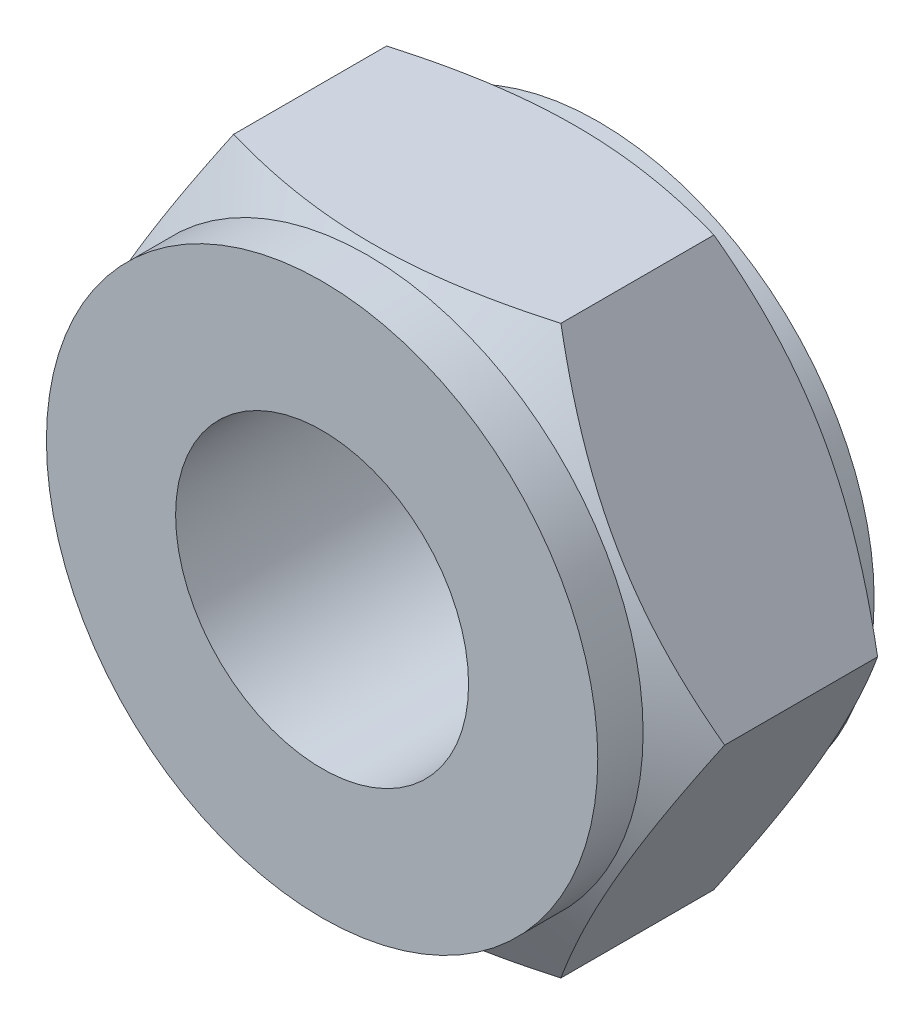
ISO-10303-21;
HEADER;
FILE_DESCRIPTION(('STEP AP214'),'2;1');
FILE_NAME('part.step','',(''),(''),'','','');
FILE_SCHEMA(('AUTOMOTIVE_DESIGN { 1 0 10303 214 1 1 1 1 }'));
ENDSEC;
DATA;
#1=APPLICATION_CONTEXT('core data for automotive mechanical design processes');
#2=APPLICATION_PROTOCOL_DEFINITION('international standard','automotive_design',2000,#1);
#3=PRODUCT_CONTEXT('',#1,'mechanical');
#4=PRODUCT('Part','Part','',(#3));
#5=PRODUCT_RELATED_PRODUCT_CATEGORY('part','',(#4));
#6=PRODUCT_DEFINITION_FORMATION('','',#4);
#7=PRODUCT_DEFINITION_CONTEXT('part definition',#1,'design');
#8=PRODUCT_DEFINITION('design','',#6,#7);
#9=PRODUCT_DEFINITION_SHAPE('','',#8);
#10=(LENGTH_UNIT() NAMED_UNIT(*) SI_UNIT(.MILLI.,.METRE.));
#11=(NAMED_UNIT(*) PLANE_ANGLE_UNIT() SI_UNIT($,.RADIAN.));
#12=(NAMED_UNIT(*) SI_UNIT($,.STERADIAN.) SOLID_ANGLE_UNIT());
#13=UNCERTAINTY_MEASURE_WITH_UNIT(LENGTH_MEASURE(1.E-05),#10,'distance_accuracy_value','');
#14=(GEOMETRIC_REPRESENTATION_CONTEXT(3) GLOBAL_UNCERTAINTY_ASSIGNED_CONTEXT((#13)) GLOBAL_UNIT_ASSIGNED_CONTEXT((#10,
#11,#12)) REPRESENTATION_CONTEXT('',''));
#15=CARTESIAN_POINT('',(0.,0.,0.));
#16=DIRECTION('',(0.,0.,1.));
#17=DIRECTION('',(1.,0.,0.));
#18=AXIS2_PLACEMENT_3D('',#15,#16,#17);
#19=CARTESIAN_POINT('',(0.,0.,3.28));
#20=DIRECTION('',(0.,0.,-1.));
#21=DIRECTION('',(-1.,0.,0.));
#22=AXIS2_PLACEMENT_3D('',#19,#20,#21);
#23=CYLINDRICAL_SURFACE('',#22,3.89);
#24=CARTESIAN_POINT('',(0.,0.,-3.52));
#25=DIRECTION('',(0.,0.,-1.));
#26=DIRECTION('',(-1.,0.,0.));
#27=AXIS2_PLACEMENT_3D('',#24,#25,#26);
#28=CIRCLE('',#27,3.89);
#29=CARTESIAN_POINT('',(-3.89,0.,-3.52));
#30=VERTEX_POINT('',#29);
#31=EDGE_CURVE('E19',#30,#30,#28,.T.);
#32=ORIENTED_EDGE('',*,*,#31,.F.);
#33=EDGE_LOOP('',(#32));
#34=FACE_BOUND('',#33,.T.);
#35=CARTESIAN_POINT('',(0.,0.,-3.26019237883202));
#36=DIRECTION('',(0.,0.,1.));
#37=DIRECTION('',(-1.,0.,0.));
#38=AXIS2_PLACEMENT_3D('',#35,#36,#37);
#39=CIRCLE('',#38,3.89000000006945);
#40=CARTESIAN_POINT('',(-3.89000000006945,0.,-3.26019237883202));
#41=VERTEX_POINT('',#40);
#42=EDGE_CURVE('E178',#41,#41,#39,.T.);
#43=ORIENTED_EDGE('',*,*,#42,.F.);
#44=EDGE_LOOP('',(#43));
#45=FACE_BOUND('',#44,.T.);
#46=ADVANCED_FACE('F16',(#34,#45),#23,.T.);
#47=CARTESIAN_POINT('',(0.,0.,-2.83689361464212));
#48=DIRECTION('',(0.,0.,1.));
#49=DIRECTION('',(1.,0.,0.));
#50=AXIS2_PLACEMENT_3D('',#47,#48,#49);
#51=CONICAL_SURFACE('',#50,4.62317496641163,1.04719755119624);
#52=CARTESIAN_POINT('',(-4.61880215351368,-5.73590683433179E-12,-2.83941825934587));
#53=CARTESIAN_POINT('',(-4.51731796242767,-0.175775775131739,-2.89802716909246));
#54=CARTESIAN_POINT('',(-4.41495776124794,-0.353068844247999,-2.95132890514521));
#55=CARTESIAN_POINT('',(-4.20846506047572,-0.710724693377609,-3.04436548454486));
#56=CARTESIAN_POINT('',(-4.10432889310188,-0.891093826174593,-3.08406741866906));
#57=CARTESIAN_POINT('',(-3.89734706567413,-1.24959686752292,-3.14586634145278));
#58=CARTESIAN_POINT('',(-3.79453324350631,-1.42767563123793,-3.16837468415098));
#59=CARTESIAN_POINT('',(-3.5884220785619,-1.78467064092886,-3.19523992308358));
#60=CARTESIAN_POINT('',(-3.4851254844293,-1.96358559021534,-3.1996190713959));
#61=CARTESIAN_POINT('',(-3.29212687968423,-2.29786897942371,-3.19048567903444));
#62=CARTESIAN_POINT('',(-3.2023959080588,-2.45328758129148,-3.1792156889114));
#63=CARTESIAN_POINT('',(-3.02351853281839,-2.76311228353242,-3.14350365790747));
#64=CARTESIAN_POINT('',(-2.93437274743071,-2.91751731310451,-3.11904942980642));
#65=CARTESIAN_POINT('',(-2.75512686792788,-3.22798028345079,-3.05791859266708));
#66=CARTESIAN_POINT('',(-2.66504944835346,-3.38399895076839,-3.02098297490716));
#67=CARTESIAN_POINT('',(-2.48623772534369,-3.69370994001023,-2.93715473766519));
#68=CARTESIAN_POINT('',(-2.39750113289062,-3.84740622662948,-2.89028180183956));
#69=CARTESIAN_POINT('',(-2.30940107675872,-3.99999999999961,-2.83941825934408));
#70=B_SPLINE_CURVE_WITH_KNOTS('',3,(#52,#53,#54,#55,#56,#57,#58,#59,#60,#61,#62,#63,#64,#65,#66,
#67,#68,#69),.UNSPECIFIED.,.F.,.F.,(4,2,2,2,2,2,2,2,4),(0.,0.634032023113349,1.26958763405349,
1.88941521230476,2.5084817777942,3.04741556526093,3.58684838758453,4.13824324497157,
4.68855594702268),.UNSPECIFIED.);
#71=CARTESIAN_POINT('',(-4.6188021534735,0.,-2.83941825937969));
#72=VERTEX_POINT('',#71);
#73=CARTESIAN_POINT('',(-2.30940107675838,-3.99999999999981,-2.83941825934408));
#74=VERTEX_POINT('',#73);
#75=EDGE_CURVE('E62',#72,#74,#70,.T.);
#76=ORIENTED_EDGE('',*,*,#75,.F.);
#77=CARTESIAN_POINT('',(-2.30940107675872,3.99999999999961,-2.83941825934408));
#78=CARTESIAN_POINT('',(-2.41088526784479,3.82422422487352,-2.89802716909082));
#79=CARTESIAN_POINT('',(-2.51324546902457,3.64693115575717,-2.95132890514373));
#80=CARTESIAN_POINT('',(-2.7197381697969,3.28927530662738,-3.0443654845437));
#81=CARTESIAN_POINT('',(-2.82387433717079,3.1089061738303,-3.08406741866806));
#82=CARTESIAN_POINT('',(-3.03085616459866,2.75040313248178,-3.14586634145211));
#83=CARTESIAN_POINT('',(-3.13366998676653,2.57232436876667,-3.16837468415047));
#84=CARTESIAN_POINT('',(-3.33978115171107,2.21532935907552,-3.19523992308339));
#85=CARTESIAN_POINT('',(-3.44307774584373,2.03641440978893,-3.19961907139588));
#86=CARTESIAN_POINT('',(-3.6360763505888,1.70213102058056,-3.19048567903468));
#87=CARTESIAN_POINT('',(-3.72580732221417,1.5467124187129,-3.17921568891178));
#88=CARTESIAN_POINT('',(-3.90468469745445,1.23688771647217,-3.14350365790813));
#89=CARTESIAN_POINT('',(-3.99383048284208,1.08248268690018,-3.11904942980722));
#90=CARTESIAN_POINT('',(-4.1730763623448,0.772019716554091,-3.05791859266816));
#91=CARTESIAN_POINT('',(-4.26315378191916,0.616001049236596,-3.02098297490839));
#92=CARTESIAN_POINT('',(-4.44196550492881,0.306290059994944,-2.9371547376667));
#93=CARTESIAN_POINT('',(-4.53070209738183,0.152593773375783,-2.89028180184121));
#94=CARTESIAN_POINT('',(-4.61880215351369,5.74348867595268E-12,-2.83941825934587));
#95=B_SPLINE_CURVE_WITH_KNOTS('',3,(#77,#78,#79,#80,#81,#82,#83,#84,#85,#86,#87,#88,#89,#90,#91,
#92,#93,#94),.UNSPECIFIED.,.F.,.F.,(4,2,2,2,2,2,2,2,4),(0.,0.63403202311376,1.26958763405432,
1.88941521230599,2.50848177779582,3.04741556526215,3.58684838758535,4.13824324497197,
4.68855594702266),.UNSPECIFIED.);
#96=CARTESIAN_POINT('',(-2.30940107675839,3.99999999999981,-2.83941825934408));
#97=VERTEX_POINT('',#96);
#98=EDGE_CURVE('E67',#97,#72,#95,.T.);
#99=ORIENTED_EDGE('',*,*,#98,.F.);
#100=CARTESIAN_POINT('',(2.30940107675805,4.,-2.83941825934408));
#101=CARTESIAN_POINT('',(2.10643269458592,4.,-2.89802716909082));
#102=CARTESIAN_POINT('',(1.90171229222636,4.,-2.95132890514373));
#103=CARTESIAN_POINT('',(1.48872689068169,4.,-3.0443654845437));
#104=CARTESIAN_POINT('',(1.2804545559339,4.,-3.08406741866807));
#105=CARTESIAN_POINT('',(0.866490901078168,4.,-3.14586634145211));
#106=CARTESIAN_POINT('',(0.660863256742426,4.,-3.16837468415047));
#107=CARTESIAN_POINT('',(0.248640926853356,4.,-3.19523992308339));
#108=CARTESIAN_POINT('',(0.0420477385880334,4.,-3.19961907139587));
#109=CARTESIAN_POINT('',(-0.343949470902628,4.,-3.19048567903466));
#110=CARTESIAN_POINT('',(-0.523411414153886,4.,-3.17921568891171));
#111=CARTESIAN_POINT('',(-0.881166164635488,4.,-3.14350365790788));
#112=CARTESIAN_POINT('',(-1.05945773541124,4.,-3.11904942980684));
#113=CARTESIAN_POINT('',(-1.41794949441772,4.,-3.05791859266747));
#114=CARTESIAN_POINT('',(-1.59810433356697,4.,-3.02098297490751));
#115=CARTESIAN_POINT('',(-1.95572777958731,4.,-2.93715473766539));
#116=CARTESIAN_POINT('',(-2.13320096449385,4.,-2.89028180183967));
#117=CARTESIAN_POINT('',(-2.30940107675805,4.,-2.83941825934408));
#118=B_SPLINE_CURVE_WITH_KNOTS('',3,(#100,#101,#102,#103,#104,#105,#106,#107,#108,#109,#110,
#111,#112,#113,#114,#115,#116,#117),.UNSPECIFIED.,.F.,.F.,(4,2,2,2,2,2,2,2,4),(0.,
0.634032023113766,1.26958763405433,1.88941521230599,2.50848177779582,3.04741556526371,
3.58684838758848,4.13824324497675,4.68855594702908),.UNSPECIFIED.);
#119=CARTESIAN_POINT('',(2.30940107675839,3.99999999999981,-2.83941825934408));
#120=VERTEX_POINT('',#119);
#121=EDGE_CURVE('E79',#120,#97,#118,.T.);
#122=ORIENTED_EDGE('',*,*,#121,.F.);
#123=CARTESIAN_POINT('',(4.61880215351369,5.73604323312061E-12,-2.83941825934586));
#124=CARTESIAN_POINT('',(4.51731796242768,0.17577577513174,-2.89802716909245));
#125=CARTESIAN_POINT('',(4.41495776124795,0.353068844248001,-2.95132890514521));
#126=CARTESIAN_POINT('',(4.20846506047573,0.710724693377611,-3.04436548454486));
#127=CARTESIAN_POINT('',(4.10432889310189,0.891093826174595,-3.08406741866906));
#128=CARTESIAN_POINT('',(3.89734706567413,1.24959686752292,-3.14586634145277));
#129=CARTESIAN_POINT('',(3.79453324350632,1.42767563123793,-3.16837468415097));
#130=CARTESIAN_POINT('',(3.5884220785619,1.78467064092887,-3.19523992308357));
#131=CARTESIAN_POINT('',(3.4851254844293,1.96358559021535,-3.1996190713959));
#132=CARTESIAN_POINT('',(3.29212687968424,2.29786897942371,-3.19048567903443));
#133=CARTESIAN_POINT('',(3.2023959080588,2.45328758129148,-3.1792156889114));
#134=CARTESIAN_POINT('',(3.0235185328184,2.76311228353242,-3.14350365790747));
#135=CARTESIAN_POINT('',(2.93437274743072,2.91751731310451,-3.11904942980641));
#136=CARTESIAN_POINT('',(2.75512686792788,3.2279802834508,-3.05791859266707));
#137=CARTESIAN_POINT('',(2.66504944835347,3.38399895076839,-3.02098297490715));
#138=CARTESIAN_POINT('',(2.4862377253437,3.69370994001023,-2.93715473766518));
#139=CARTESIAN_POINT('',(2.39750113289063,3.84740622662948,-2.89028180183956));
#140=CARTESIAN_POINT('',(2.30940107675873,3.99999999999961,-2.83941825934408));
#141=B_SPLINE_CURVE_WITH_KNOTS('',3,(#123,#124,#125,#126,#127,#128,#129,#130,#131,#132,#133,
#134,#135,#136,#137,#138,#139,#140),.UNSPECIFIED.,.F.,.F.,(4,2,2,2,2,2,2,2,4),(0.,
0.63403202311335,1.26958763405349,1.88941521230476,2.50848177779421,3.04741556526093,
3.58684838758453,4.13824324497157,4.68855594702267),.UNSPECIFIED.);
#142=CARTESIAN_POINT('',(4.61880215348771,0.,-2.83941825935585));
#143=VERTEX_POINT('',#142);
#144=EDGE_CURVE('E187',#143,#120,#141,.T.);
#145=ORIENTED_EDGE('',*,*,#144,.F.);
#146=CARTESIAN_POINT('',(2.30940107675874,-3.99999999999961,-2.83941825934408));
#147=CARTESIAN_POINT('',(2.4108852678448,-3.82422422487352,-2.89802716909081));
#148=CARTESIAN_POINT('',(2.51324546902458,-3.64693115575717,-2.95132890514372));
#149=CARTESIAN_POINT('',(2.71973816979691,-3.28927530662738,-3.04436548454369));
#150=CARTESIAN_POINT('',(2.82387433717081,-3.1089061738303,-3.08406741866806));
#151=CARTESIAN_POINT('',(3.03085616459868,-2.75040313248177,-3.1458663414521));
#152=CARTESIAN_POINT('',(3.13366998676655,-2.57232436876667,-3.16837468415047));
#153=CARTESIAN_POINT('',(3.33978115171109,-2.21532935907552,-3.19523992308339));
#154=CARTESIAN_POINT('',(3.44307774584375,-2.03641440978893,-3.19961907139587));
#155=CARTESIAN_POINT('',(3.63607635058882,-1.70213102058056,-3.19048567903467));
#156=CARTESIAN_POINT('',(3.72580732221419,-1.5467124187129,-3.17921568891177));
#157=CARTESIAN_POINT('',(3.90468469745447,-1.23688771647216,-3.14350365790812));
#158=CARTESIAN_POINT('',(3.99383048284209,-1.08248268690017,-3.11904942980721));
#159=CARTESIAN_POINT('',(4.17307636234482,-0.772019716554091,-3.05791859266815));
#160=CARTESIAN_POINT('',(4.26315378191918,-0.616001049236597,-3.02098297490838));
#161=CARTESIAN_POINT('',(4.44196550492883,-0.306290059994946,-2.93715473766669));
#162=CARTESIAN_POINT('',(4.53070209738185,-0.152593773375787,-2.8902818018412));
#163=CARTESIAN_POINT('',(4.6188021535137,-5.74804397884381E-12,-2.83941825934586));
#164=B_SPLINE_CURVE_WITH_KNOTS('',3,(#146,#147,#148,#149,#150,#151,#152,#153,#154,#155,#156,
#157,#158,#159,#160,#161,#162,#163),.UNSPECIFIED.,.F.,.F.,(4,2,2,2,2,2,2,2,4),(0.,
0.634032023113761,1.26958763405432,1.88941521230599,2.50848177779583,3.04741556526215,
3.58684838758535,4.13824324497196,4.68855594702265),.UNSPECIFIED.);
#165=CARTESIAN_POINT('',(2.3094010767584,-3.9999999999998,-2.83941825934408));
#166=VERTEX_POINT('',#165);
#167=EDGE_CURVE('E110',#166,#143,#164,.T.);
#168=ORIENTED_EDGE('',*,*,#167,.F.);
#169=CARTESIAN_POINT('',(-2.30940107675804,-4.,-2.83941825934408));
#170=CARTESIAN_POINT('',(-2.10643269458591,-4.,-2.89802716909082));
#171=CARTESIAN_POINT('',(-1.90171229222635,-4.,-2.95132890514373));
#172=CARTESIAN_POINT('',(-1.48872689068169,-4.,-3.0443654845437));
#173=CARTESIAN_POINT('',(-1.2804545559339,-4.,-3.08406741866807));
#174=CARTESIAN_POINT('',(-0.866490901078162,-4.,-3.14586634145211));
#175=CARTESIAN_POINT('',(-0.66086325674242,-4.,-3.16837468415047));
#176=CARTESIAN_POINT('',(-0.24864092685335,-4.,-3.19523992308339));
#177=CARTESIAN_POINT('',(-0.0420477385880274,-4.,-3.19961907139588));
#178=CARTESIAN_POINT('',(0.343949470902635,-4.,-3.19048567903466));
#179=CARTESIAN_POINT('',(0.523411414153894,-4.,-3.17921568891171));
#180=CARTESIAN_POINT('',(0.881166164635497,-4.,-3.14350365790788));
#181=CARTESIAN_POINT('',(1.05945773541125,-4.,-3.11904942980684));
#182=CARTESIAN_POINT('',(1.41794949441773,-4.,-3.05791859266747));
#183=CARTESIAN_POINT('',(1.59810433356698,-4.,-3.02098297490751));
#184=CARTESIAN_POINT('',(1.95572777958732,-4.,-2.93715473766539));
#185=CARTESIAN_POINT('',(2.13320096449386,-4.,-2.89028180183967));
#186=CARTESIAN_POINT('',(2.30940107675806,-4.,-2.83941825934408));
#187=B_SPLINE_CURVE_WITH_KNOTS('',3,(#169,#170,#171,#172,#173,#174,#175,#176,#177,#178,#179,
#180,#181,#182,#183,#184,#185,#186),.UNSPECIFIED.,.F.,.F.,(4,2,2,2,2,2,2,2,4),(0.,
0.634032023113765,1.26958763405433,1.88941521230599,2.50848177779582,3.04741556526371,
3.58684838758848,4.13824324497675,4.68855594702909),.UNSPECIFIED.);
#188=EDGE_CURVE('E70',#74,#166,#187,.T.);
#189=ORIENTED_EDGE('',*,*,#188,.F.);
#190=EDGE_LOOP('',(#76,#99,#122,#145,#168,#189));
#191=FACE_BOUND('',#190,.T.);
#192=ORIENTED_EDGE('',*,*,#42,.T.);
#193=EDGE_LOOP('',(#192));
#194=FACE_BOUND('',#193,.T.);
#195=ADVANCED_FACE('F63',(#191,#194),#51,.T.);
#196=CARTESIAN_POINT('',(-2.30940107675849,-4.,-3.52));
#197=DIRECTION('',(0.,0.,-1.));
#198=DIRECTION('',(-1.,0.,0.));
#199=AXIS2_PLACEMENT_3D('',#196,#197,#198);
#200=PLANE('',#199);
#201=CARTESIAN_POINT('',(0.,0.,-3.52000000004606));
#202=DIRECTION('',(0.,0.,-1.));
#203=DIRECTION('',(-1.,0.,0.));
#204=AXIS2_PLACEMENT_3D('',#201,#202,#203);
#205=CIRCLE('',#204,2.87500000001728);
#206=CARTESIAN_POINT('',(-2.87500000001728,0.,-3.52000000004606));
#207=VERTEX_POINT('',#206);
#208=EDGE_CURVE('E82',#207,#207,#205,.F.);
#209=ORIENTED_EDGE('',*,*,#208,.T.);
#210=EDGE_LOOP('',(#209));
#211=FACE_BOUND('',#210,.T.);
#212=ORIENTED_EDGE('',*,*,#31,.T.);
#213=EDGE_LOOP('',(#212));
#214=FACE_BOUND('',#213,.T.);
#215=ADVANCED_FACE('F103',(#211,#214),#200,.T.);
#216=CARTESIAN_POINT('',(-4.618802153517,0.,-3.52));
#217=DIRECTION('',(-0.866025403784439,-0.5,0.));
#218=DIRECTION('',(0.5,-0.866025403784439,0.));
#219=AXIS2_PLACEMENT_3D('',#216,#217,#218);
#220=PLANE('',#219);
#221=DIRECTION('',(0.,0.,1.));
#222=VECTOR('',#221,1.);
#223=CARTESIAN_POINT('',(-4.618802153517,0.,-3.52));
#224=LINE('',#223,#222);
#225=CARTESIAN_POINT('',(-4.61880215351613,0.,-0.680581740657889));
#226=VERTEX_POINT('',#225);
#227=EDGE_CURVE('E73',#72,#226,#224,.T.);
#228=ORIENTED_EDGE('',*,*,#227,.F.);
#229=ORIENTED_EDGE('',*,*,#75,.T.);
#230=DIRECTION('',(0.,0.,1.));
#231=VECTOR('',#230,1.);
#232=CARTESIAN_POINT('',(-2.30940107675849,-4.,-3.52));
#233=LINE('',#232,#231);
#234=CARTESIAN_POINT('',(-2.30940109340961,-4.,-0.680581745467265));
#235=VERTEX_POINT('',#234);
#236=EDGE_CURVE('E72',#235,#74,#233,.F.);
#237=ORIENTED_EDGE('',*,*,#236,.F.);
#238=CARTESIAN_POINT('',(-4.61880215351596,-1.80305391824773E-12,-0.680581740659897));
#239=CARTESIAN_POINT('',(-4.51731796244398,-0.175775775103493,-0.621972830921223));
#240=CARTESIAN_POINT('',(-4.41495776127846,-0.353068844195138,-0.568671094875031));
#241=CARTESIAN_POINT('',(-4.20846506053689,-0.710724693271661,-0.475634515485113));
#242=CARTESIAN_POINT('',(-4.10432889317952,-0.891093826040126,-0.435932581363831));
#243=CARTESIAN_POINT('',(-3.89734706575416,-1.24959686738429,-0.374133658570449));
#244=CARTESIAN_POINT('',(-3.7945332435719,-1.42767563112431,-0.351625315864611));
#245=CARTESIAN_POINT('',(-3.58842207859598,-1.78467064086982,-0.324760076922744));
#246=CARTESIAN_POINT('',(-3.48512548444632,-1.96358559018586,-0.320380928609024));
#247=CARTESIAN_POINT('',(-3.29212688334392,-2.29786897308494,-0.329514320795707));
#248=CARTESIAN_POINT('',(-3.20239591537037,-2.45328756862745,-0.340784310171359));
#249=CARTESIAN_POINT('',(-3.02351854737306,-2.763112258323,-0.376496338652439));
#250=CARTESIAN_POINT('',(-2.93437276557644,-2.9175172816752,-0.400950564975588));
#251=CARTESIAN_POINT('',(-2.75512689333883,-3.22798023943772,-0.462081397681879));
#252=CARTESIAN_POINT('',(-2.66504947743503,-3.38399890039763,-0.49901701275454));
#253=CARTESIAN_POINT('',(-2.48623776163293,-3.69370987715542,-0.582845244037596));
#254=CARTESIAN_POINT('',(-2.3975011727174,-3.84740615764747,-0.629718176595119));
#255=CARTESIAN_POINT('',(-2.30940112007343,-3.99999992497632,-0.680581715652609));
#256=B_SPLINE_CURVE_WITH_KNOTS('',3,(#238,#239,#240,#241,#242,#243,#244,#245,#246,#247,#248,
#249,#250,#251,#252,#253,#254,#255),.UNSPECIFIED.,.F.,.F.,(4,2,2,2,2,2,2,2,4),(0.,
0.634032023026007,1.26958763386756,1.88941521220828,2.50848177779535,3.04741554331967,
3.58684834361968,4.13824317783946,4.68855585689971),.UNSPECIFIED.);
#257=EDGE_CURVE('E34',#226,#235,#256,.T.);
#258=ORIENTED_EDGE('',*,*,#257,.F.);
#259=EDGE_LOOP('',(#228,#229,#237,#258));
#260=FACE_BOUND('',#259,.T.);
#261=ADVANCED_FACE('F74',(#260),#220,.T.);
#262=CARTESIAN_POINT('',(-2.30940107675849,-4.,-3.52));
#263=DIRECTION('',(0.,-1.,0.));
#264=DIRECTION('',(1.,0.,0.));
#265=AXIS2_PLACEMENT_3D('',#262,#263,#264);
#266=PLANE('',#265);
#267=ORIENTED_EDGE('',*,*,#236,.T.);
#268=ORIENTED_EDGE('',*,*,#188,.T.);
#269=DIRECTION('',(0.,0.,1.));
#270=VECTOR('',#269,1.);
#271=CARTESIAN_POINT('',(2.30940107675852,-4.,-3.52));
#272=LINE('',#271,#270);
#273=CARTESIAN_POINT('',(2.30940106843087,-4.00000001442391,-0.680581745468477));
#274=VERTEX_POINT('',#273);
#275=EDGE_CURVE('E124',#274,#166,#272,.F.);
#276=ORIENTED_EDGE('',*,*,#275,.F.);
#277=CARTESIAN_POINT('',(-2.30940110351642,-3.99999996248763,-0.680581772944216));
#278=CARTESIAN_POINT('',(-2.10643272249927,-3.99999998652724,-0.621972847174614));
#279=CARTESIAN_POINT('',(-1.90171231902133,-3.99999999638907,-0.568671103799689));
#280=CARTESIAN_POINT('',(-1.48872691340506,-4.0000000036196,-0.475634517672028));
#281=CARTESIAN_POINT('',(-1.28045457570248,-4.00000000095822,-0.43593258414569));
#282=CARTESIAN_POINT('',(-0.866490915803741,-3.99999999906549,-0.374133660889823));
#283=CARTESIAN_POINT('',(-0.660863269373307,-3.99999999975089,-0.351625317135899));
#284=CARTESIAN_POINT('',(-0.248640935005505,-4.0000000002488,-0.324760076994751));
#285=CARTESIAN_POINT('',(-0.042047744355798,-4.00000000006239,-0.320380928537159));
#286=CARTESIAN_POINT('',(0.343949460368308,-3.99999999994568,-0.329514320663676));
#287=CARTESIAN_POINT('',(0.523411396493218,-3.99999999998536,-0.340784309946792));
#288=CARTESIAN_POINT('',(0.881166132795949,-4.00000000001465,-0.376496338300437));
#289=CARTESIAN_POINT('',(1.05945769651991,-4.00000000000422,-0.400950564584484));
#290=CARTESIAN_POINT('',(1.41794944151398,-3.99999999999568,-0.462081397272556));
#291=CARTESIAN_POINT('',(1.59810427370667,-3.99999999999784,-0.499017012383614));
#292=CARTESIAN_POINT('',(1.95572770615214,-4.00000000000215,-0.582845243809378));
#293=CARTESIAN_POINT('',(2.13320088443837,-4.0000000000043,-0.629718176475666));
#294=CARTESIAN_POINT('',(2.30940099017536,-4.,-0.680581715666101));
#295=B_SPLINE_CURVE_WITH_KNOTS('',3,(#277,#278,#279,#280,#281,#282,#283,#284,#285,#286,#287,
#288,#289,#290,#291,#292,#293,#294),.UNSPECIFIED.,.F.,.F.,(4,2,2,2,2,2,2,2,4),(0.,
0.634032031834983,1.26958765081319,1.88941523582196,2.50848180835725,3.0474155744189,
3.58684837508235,4.13824321045645,4.68855589091895),.UNSPECIFIED.);
#296=EDGE_CURVE('E135',#235,#274,#295,.T.);
#297=ORIENTED_EDGE('',*,*,#296,.F.);
#298=EDGE_LOOP('',(#267,#268,#276,#297));
#299=FACE_BOUND('',#298,.T.);
#300=ADVANCED_FACE('F125',(#299),#266,.T.);
#301=CARTESIAN_POINT('',(2.30940107675852,-4.,-3.52));
#302=DIRECTION('',(0.866025403784439,-0.5,0.));
#303=DIRECTION('',(0.5,0.866025403784439,0.));
#304=AXIS2_PLACEMENT_3D('',#301,#302,#303);
#305=PLANE('',#304);
#306=ORIENTED_EDGE('',*,*,#275,.T.);
#307=ORIENTED_EDGE('',*,*,#167,.T.);
#308=DIRECTION('',(0.,0.,1.));
#309=VECTOR('',#308,1.);
#310=CARTESIAN_POINT('',(4.61880215351701,0.,-3.52));
#311=LINE('',#310,#309);
#312=CARTESIAN_POINT('',(4.61880215351597,0.,-0.680581740659905));
#313=VERTEX_POINT('',#312);
#314=EDGE_CURVE('E184',#313,#143,#311,.F.);
#315=ORIENTED_EDGE('',*,*,#314,.F.);
#316=CARTESIAN_POINT('',(2.30940103090809,-4.00000000444028,-0.680581772931595));
#317=CARTESIAN_POINT('',(2.41088524223646,-3.82422424230081,-0.621972847163885));
#318=CARTESIAN_POINT('',(2.51324545252448,-3.64693117711912,-0.568671103786385));
#319=CARTESIAN_POINT('',(2.71973816162016,-3.28927532802434,-0.475634517651644));
#320=CARTESIAN_POINT('',(2.82387432818394,-3.10890619131118,-0.435932584121048));
#321=CARTESIAN_POINT('',(3.03085615649661,-2.75040314464718,-0.374133660873277));
#322=CARTESIAN_POINT('',(3.1336699802902,-2.57232437948613,-0.35162531712675));
#323=CARTESIAN_POINT('',(3.33978114787275,-2.21532936622099,-0.324760076993857));
#324=CARTESIAN_POINT('',(3.44307774301879,-2.0364144148066,-0.320380928536883));
#325=CARTESIAN_POINT('',(3.63607634892112,-1.70213102336053,-0.329514320836684));
#326=CARTESIAN_POINT('',(3.72580732066883,-1.54671242136028,-0.340784310866357));
#327=CARTESIAN_POINT('',(3.90468469608674,-1.23688771887043,-0.376496341740967));
#328=CARTESIAN_POINT('',(3.99383048152983,-1.08248268918152,-0.400950569801861));
#329=CARTESIAN_POINT('',(4.17307636128278,-0.772019718384964,-0.462081406920684));
#330=CARTESIAN_POINT('',(4.2631537810506,-0.616001050736709,-0.499017024717738));
#331=CARTESIAN_POINT('',(4.44196550448273,-0.306290060771917,-0.582845262099807));
#332=CARTESIAN_POINT('',(4.53070209716425,-0.152593773761278,-0.629718198032846));
#333=CARTESIAN_POINT('',(4.61880215351597,-1.81536132999244E-12,-0.680581740659906));
#334=B_SPLINE_CURVE_WITH_KNOTS('',3,(#316,#317,#318,#319,#320,#321,#322,#323,#324,#325,#326,
#327,#328,#329,#330,#331,#332,#333),.UNSPECIFIED.,.F.,.F.,(4,2,2,2,2,2,2,2,4),(0.,
0.634032031918795,1.26958765099256,1.88941523590971,2.508481808345,3.04741559634307,
3.58684841902422,4.13824327755889,4.68855598100544),.UNSPECIFIED.);
#335=EDGE_CURVE('E142',#274,#313,#334,.T.);
#336=ORIENTED_EDGE('',*,*,#335,.F.);
#337=EDGE_LOOP('',(#306,#307,#315,#336));
#338=FACE_BOUND('',#337,.T.);
#339=ADVANCED_FACE('F128',(#338),#305,.T.);
#340=CARTESIAN_POINT('',(4.61880215351701,0.,-3.52));
#341=DIRECTION('',(0.866025403784439,0.5,0.));
#342=DIRECTION('',(-0.5,0.866025403784439,0.));
#343=AXIS2_PLACEMENT_3D('',#340,#341,#342);
#344=PLANE('',#343);
#345=ORIENTED_EDGE('',*,*,#314,.T.);
#346=ORIENTED_EDGE('',*,*,#144,.T.);
#347=DIRECTION('',(0.,0.,1.));
#348=VECTOR('',#347,1.);
#349=CARTESIAN_POINT('',(2.3094010767585,4.,-3.52));
#350=LINE('',#349,#348);
#351=CARTESIAN_POINT('',(2.30940109340859,4.,-0.680581745466972));
#352=VERTEX_POINT('',#351);
#353=EDGE_CURVE('E188',#352,#120,#350,.F.);
#354=ORIENTED_EDGE('',*,*,#353,.F.);
#355=CARTESIAN_POINT('',(4.61880215351596,1.80430192027607E-12,-0.680581740659903));
#356=CARTESIAN_POINT('',(4.51731796244399,0.175775775103495,-0.621972830921228));
#357=CARTESIAN_POINT('',(4.41495776127847,0.353068844195141,-0.568671094875036));
#358=CARTESIAN_POINT('',(4.20846506053689,0.710724693271667,-0.475634515485118));
#359=CARTESIAN_POINT('',(4.10432889317952,0.891093826040132,-0.435932581363836));
#360=CARTESIAN_POINT('',(3.89734706575417,1.24959686738429,-0.374133658570454));
#361=CARTESIAN_POINT('',(3.79453324357191,1.42767563112432,-0.351625315864617));
#362=CARTESIAN_POINT('',(3.58842207859599,1.78467064086982,-0.324760076922749));
#363=CARTESIAN_POINT('',(3.48512548444633,1.96358559018586,-0.320380928609029));
#364=CARTESIAN_POINT('',(3.29212688334384,2.29786897308508,-0.329514320795716));
#365=CARTESIAN_POINT('',(3.20239591537022,2.45328756862774,-0.340784310171385));
#366=CARTESIAN_POINT('',(3.02351854737274,2.76311225832357,-0.376496338652522));
#367=CARTESIAN_POINT('',(2.93437276557603,2.91751728167591,-0.40095056497571));
#368=CARTESIAN_POINT('',(2.75512689333827,3.22798023943872,-0.4620813976821));
#369=CARTESIAN_POINT('',(2.66504947743438,3.38399890039877,-0.499017012754822));
#370=CARTESIAN_POINT('',(2.48623776163213,3.69370987715684,-0.582845244038013));
#371=CARTESIAN_POINT('',(2.39750117271652,3.84740615764903,-0.62971817659561));
#372=CARTESIAN_POINT('',(2.30940112007247,3.99999992497801,-0.680581715653176));
#373=B_SPLINE_CURVE_WITH_KNOTS('',3,(#355,#356,#357,#358,#359,#360,#361,#362,#363,#364,#365,
#366,#367,#368,#369,#370,#371,#372),.UNSPECIFIED.,.F.,.F.,(4,2,2,2,2,2,2,2,4),(0.,
0.63403202302601,1.26958763386756,1.88941521220829,2.50848177779535,3.04741554332016,
3.58684834362067,4.13824317784097,4.68855585690174),.UNSPECIFIED.);
#374=EDGE_CURVE('E333',#313,#352,#373,.T.);
#375=ORIENTED_EDGE('',*,*,#374,.F.);
#376=EDGE_LOOP('',(#345,#346,#354,#375));
#377=FACE_BOUND('',#376,.T.);
#378=ADVANCED_FACE('F257',(#377),#344,.T.);
#379=CARTESIAN_POINT('',(2.3094010767585,4.,-3.52));
#380=DIRECTION('',(0.,1.,0.));
#381=DIRECTION('',(-1.,0.,0.));
#382=AXIS2_PLACEMENT_3D('',#379,#380,#381);
#383=PLANE('',#382);
#384=ORIENTED_EDGE('',*,*,#353,.T.);
#385=ORIENTED_EDGE('',*,*,#121,.T.);
#386=DIRECTION('',(0.,0.,1.));
#387=VECTOR('',#386,1.);
#388=CARTESIAN_POINT('',(-2.3094010767585,4.,-3.52));
#389=LINE('',#388,#387);
#390=CARTESIAN_POINT('',(-2.30940106843097,4.0000000144237,-0.680581745468403));
#391=VERTEX_POINT('',#390);
#392=EDGE_CURVE('E78',#391,#97,#389,.F.);
#393=ORIENTED_EDGE('',*,*,#392,.F.);
#394=CARTESIAN_POINT('',(2.30940110351448,3.99999996248827,-0.680581772943237));
#395=CARTESIAN_POINT('',(2.10643272249734,3.99999998652747,-0.621972847173943));
#396=CARTESIAN_POINT('',(1.90171231901945,3.99999999638914,-0.568671103799182));
#397=CARTESIAN_POINT('',(1.4887269134033,4.00000000361954,-0.475634517671714));
#398=CARTESIAN_POINT('',(1.28045457570079,4.00000000095821,-0.435932584145406));
#399=CARTESIAN_POINT('',(0.866490915802194,3.99999999906551,-0.374133660889626));
#400=CARTESIAN_POINT('',(0.660863269371822,3.9999999997509,-0.351625317135759));
#401=CARTESIAN_POINT('',(0.248640935004154,4.0000000002488,-0.324760076994709));
#402=CARTESIAN_POINT('',(0.0420477443545168,4.00000000006239,-0.320380928537156));
#403=CARTESIAN_POINT('',(-0.34394946036946,3.99999999994569,-0.329514320663737));
#404=CARTESIAN_POINT('',(-0.523411396494312,3.99999999998536,-0.340784309946878));
#405=CARTESIAN_POINT('',(-0.881166132796926,4.00000000001466,-0.376496338300563));
#406=CARTESIAN_POINT('',(-1.05945769652083,4.00000000000423,-0.400950564584625));
#407=CARTESIAN_POINT('',(-1.41794944151477,3.99999999999568,-0.462081397272715));
#408=CARTESIAN_POINT('',(-1.5981042737074,3.99999999999785,-0.499017012383775));
#409=CARTESIAN_POINT('',(-1.95572770615274,4.00000000000216,-0.582845243809535));
#410=CARTESIAN_POINT('',(-2.1332008844389,4.00000000000431,-0.629718176475817));
#411=CARTESIAN_POINT('',(-2.30940099017583,4.,-0.680581715666241));
#412=B_SPLINE_CURVE_WITH_KNOTS('',3,(#394,#395,#396,#397,#398,#399,#400,#401,#402,#403,#404,
#405,#406,#407,#408,#409,#410,#411),.UNSPECIFIED.,.F.,.F.,(4,2,2,2,2,2,2,2,4),(0.,
0.634032031834733,1.2695876508127,1.88941523582127,2.50848180835634,3.04741557441782,
3.5868483750811,4.13824321045501,4.68855589091732),.UNSPECIFIED.);
#413=EDGE_CURVE('E161',#352,#391,#412,.T.);
#414=ORIENTED_EDGE('',*,*,#413,.F.);
#415=EDGE_LOOP('',(#384,#385,#393,#414));
#416=FACE_BOUND('',#415,.T.);
#417=ADVANCED_FACE('F218',(#416),#383,.T.);
#418=CARTESIAN_POINT('',(-2.3094010767585,4.,-3.52));
#419=DIRECTION('',(-0.866025403784439,0.5,0.));
#420=DIRECTION('',(-0.5,-0.866025403784439,0.));
#421=AXIS2_PLACEMENT_3D('',#418,#419,#420);
#422=PLANE('',#421);
#423=ORIENTED_EDGE('',*,*,#392,.T.);
#424=ORIENTED_EDGE('',*,*,#98,.T.);
#425=ORIENTED_EDGE('',*,*,#227,.T.);
#426=CARTESIAN_POINT('',(-2.30940103090844,4.00000000443996,-0.68058177293136));
#427=CARTESIAN_POINT('',(-2.41088524223672,3.82422424230045,-0.621972847163723));
#428=CARTESIAN_POINT('',(-2.5132454525247,3.64693117711875,-0.568671103786262));
#429=CARTESIAN_POINT('',(-2.71973816162034,3.28927532802397,-0.475634517651565));
#430=CARTESIAN_POINT('',(-2.82387432818412,3.10890619131083,-0.435932584120975));
#431=CARTESIAN_POINT('',(-3.03085615649678,2.75040314464687,-0.374133660873224));
#432=CARTESIAN_POINT('',(-3.13366998029036,2.57232437948584,-0.35162531712671));
#433=CARTESIAN_POINT('',(-3.33978114787289,2.21532936622072,-0.32476007699384));
#434=CARTESIAN_POINT('',(-3.44307774301892,2.03641441480634,-0.320380928536874));
#435=CARTESIAN_POINT('',(-3.63607634892124,1.70213102336031,-0.329514320836689));
#436=CARTESIAN_POINT('',(-3.72580732066893,1.54671242136008,-0.340784310866367));
#437=CARTESIAN_POINT('',(-3.90468469608682,1.23688771887027,-0.376496341740983));
#438=CARTESIAN_POINT('',(-3.9938304815299,1.08248268918137,-0.400950569801878));
#439=CARTESIAN_POINT('',(-4.17307636128282,0.772019718384856,-0.462081406920701));
#440=CARTESIAN_POINT('',(-4.26315378105063,0.616001050736621,-0.499017024717752));
#441=CARTESIAN_POINT('',(-4.44196550448274,0.306290060771869,-0.582845262099813));
#442=CARTESIAN_POINT('',(-4.53070209716425,0.152593773761249,-0.629718198032846));
#443=CARTESIAN_POINT('',(-4.61880215351596,1.80617967026798E-12,-0.6805817406599));
#444=B_SPLINE_CURVE_WITH_KNOTS('',3,(#426,#427,#428,#429,#430,#431,#432,#433,#434,#435,#436,
#437,#438,#439,#440,#441,#442,#443),.UNSPECIFIED.,.F.,.F.,(4,2,2,2,2,2,2,2,4),(0.,
0.634032031918734,1.26958765099245,1.88941523590954,2.50848180834478,3.04741559634279,
3.58684841902387,4.13824327755847,4.68855598100495),.UNSPECIFIED.);
#445=EDGE_CURVE('E169',#391,#226,#444,.T.);
#446=ORIENTED_EDGE('',*,*,#445,.F.);
#447=EDGE_LOOP('',(#423,#424,#425,#446));
#448=FACE_BOUND('',#447,.T.);
#449=ADVANCED_FACE('F81',(#448),#422,.T.);
#450=CARTESIAN_POINT('',(0.,0.,-3.51999999998043));
#451=DIRECTION('',(0.,0.,-1.));
#452=DIRECTION('',(-1.,0.,0.));
#453=AXIS2_PLACEMENT_3D('',#450,#451,#452);
#454=CONICAL_SURFACE('',#453,2.87499999990359,1.04719755119535);
#455=ORIENTED_EDGE('',*,*,#208,.F.);
#456=EDGE_LOOP('',(#455));
#457=FACE_BOUND('',#456,.T.);
#458=CARTESIAN_POINT('',(0.,0.,-3.05350098249479));
#459=DIRECTION('',(0.,0.,1.));
#460=DIRECTION('',(1.,0.,0.));
#461=AXIS2_PLACEMENT_3D('',#458,#459,#460);
#462=CIRCLE('',#461,2.067);
#463=CARTESIAN_POINT('',(2.067,0.,-3.05350098249479));
#464=VERTEX_POINT('',#463);
#465=EDGE_CURVE('E174',#464,#464,#462,.T.);
#466=ORIENTED_EDGE('',*,*,#465,.T.);
#467=EDGE_LOOP('',(#466));
#468=FACE_BOUND('',#467,.T.);
#469=ADVANCED_FACE('F155',(#457,#468),#454,.F.);
#470=CARTESIAN_POINT('',(0.,0.,-0.683106385395149));
#471=DIRECTION('',(0.,0.,-1.));
#472=DIRECTION('',(-1.,0.,0.));
#473=AXIS2_PLACEMENT_3D('',#470,#471,#472);
#474=CONICAL_SURFACE('',#473,4.62317496646847,1.04719755119624);
#475=ORIENTED_EDGE('',*,*,#335,.T.);
#476=ORIENTED_EDGE('',*,*,#374,.T.);
#477=ORIENTED_EDGE('',*,*,#413,.T.);
#478=ORIENTED_EDGE('',*,*,#445,.T.);
#479=ORIENTED_EDGE('',*,*,#257,.T.);
#480=ORIENTED_EDGE('',*,*,#296,.T.);
#481=EDGE_LOOP('',(#475,#476,#477,#478,#479,#480));
#482=FACE_BOUND('',#481,.T.);
#483=CARTESIAN_POINT('',(0.,0.,-0.259807621135334));
#484=DIRECTION('',(0.,0.,-1.));
#485=DIRECTION('',(-1.,0.,0.));
#486=AXIS2_PLACEMENT_3D('',#483,#484,#485);
#487=CIRCLE('',#486,3.89);
#488=CARTESIAN_POINT('',(-3.89,0.,-0.259807621135334));
#489=VERTEX_POINT('',#488);
#490=EDGE_CURVE('E176',#489,#489,#487,.F.);
#491=ORIENTED_EDGE('',*,*,#490,.F.);
#492=EDGE_LOOP('',(#491));
#493=FACE_BOUND('',#492,.T.);
#494=ADVANCED_FACE('F150',(#482,#493),#474,.T.);
#495=CARTESIAN_POINT('',(0.,0.,-3.52));
#496=DIRECTION('',(0.,0.,1.));
#497=DIRECTION('',(1.,0.,0.));
#498=AXIS2_PLACEMENT_3D('',#495,#496,#497);
#499=CYLINDRICAL_SURFACE('',#498,2.067);
#500=CARTESIAN_POINT('',(0.,0.,0.38));
#501=DIRECTION('',(0.,0.,1.));
#502=DIRECTION('',(1.,0.,0.));
#503=AXIS2_PLACEMENT_3D('',#500,#501,#502);
#504=CIRCLE('',#503,2.067);
#505=CARTESIAN_POINT('',(2.067,0.,0.38));
#506=VERTEX_POINT('',#505);
#507=EDGE_CURVE('E25',#506,#506,#504,.F.);
#508=ORIENTED_EDGE('',*,*,#507,.F.);
#509=EDGE_LOOP('',(#508));
#510=FACE_BOUND('',#509,.T.);
#511=ORIENTED_EDGE('',*,*,#465,.F.);
#512=EDGE_LOOP('',(#511));
#513=FACE_BOUND('',#512,.T.);
#514=ADVANCED_FACE('F154',(#510,#513),#499,.F.);
#515=CARTESIAN_POINT('',(0.,0.,3.28));
#516=DIRECTION('',(0.,0.,-1.));
#517=DIRECTION('',(-1.,0.,0.));
#518=AXIS2_PLACEMENT_3D('',#515,#516,#517);
#519=CYLINDRICAL_SURFACE('',#518,3.89);
#520=ORIENTED_EDGE('',*,*,#490,.T.);
#521=EDGE_LOOP('',(#520));
#522=FACE_BOUND('',#521,.T.);
#523=CARTESIAN_POINT('',(0.,0.,0.38));
#524=DIRECTION('',(0.,0.,-1.));
#525=DIRECTION('',(-1.,0.,0.));
#526=AXIS2_PLACEMENT_3D('',#523,#524,#525);
#527=CIRCLE('',#526,3.89);
#528=CARTESIAN_POINT('',(-3.89,0.,0.38));
#529=VERTEX_POINT('',#528);
#530=EDGE_CURVE('E11',#529,#529,#527,.F.);
#531=ORIENTED_EDGE('',*,*,#530,.F.);
#532=EDGE_LOOP('',(#531));
#533=FACE_BOUND('',#532,.T.);
#534=ADVANCED_FACE('F196',(#522,#533),#519,.T.);
#535=CARTESIAN_POINT('',(0.,0.,0.38));
#536=DIRECTION('',(0.,0.,1.));
#537=DIRECTION('',(1.,0.,0.));
#538=AXIS2_PLACEMENT_3D('',#535,#536,#537);
#539=PLANE('',#538);
#540=ORIENTED_EDGE('',*,*,#530,.T.);
#541=EDGE_LOOP('',(#540));
#542=FACE_BOUND('',#541,.T.);
#543=ORIENTED_EDGE('',*,*,#507,.T.);
#544=EDGE_LOOP('',(#543));
#545=FACE_BOUND('',#544,.T.);
#546=ADVANCED_FACE('F200',(#542,#545),#539,.T.);
#547=CLOSED_SHELL('',(#46,#195,#215,#261,#300,#339,#378,#417,#449,#469,#494,#514,#534,#546));
#548=MANIFOLD_SOLID_BREP('B1',#547);
#549=ADVANCED_BREP_SHAPE_REPRESENTATION('',(#18,#548),#14);
#550=SHAPE_DEFINITION_REPRESENTATION(#9,#549);
ENDSEC;
END-ISO-10303-21;
